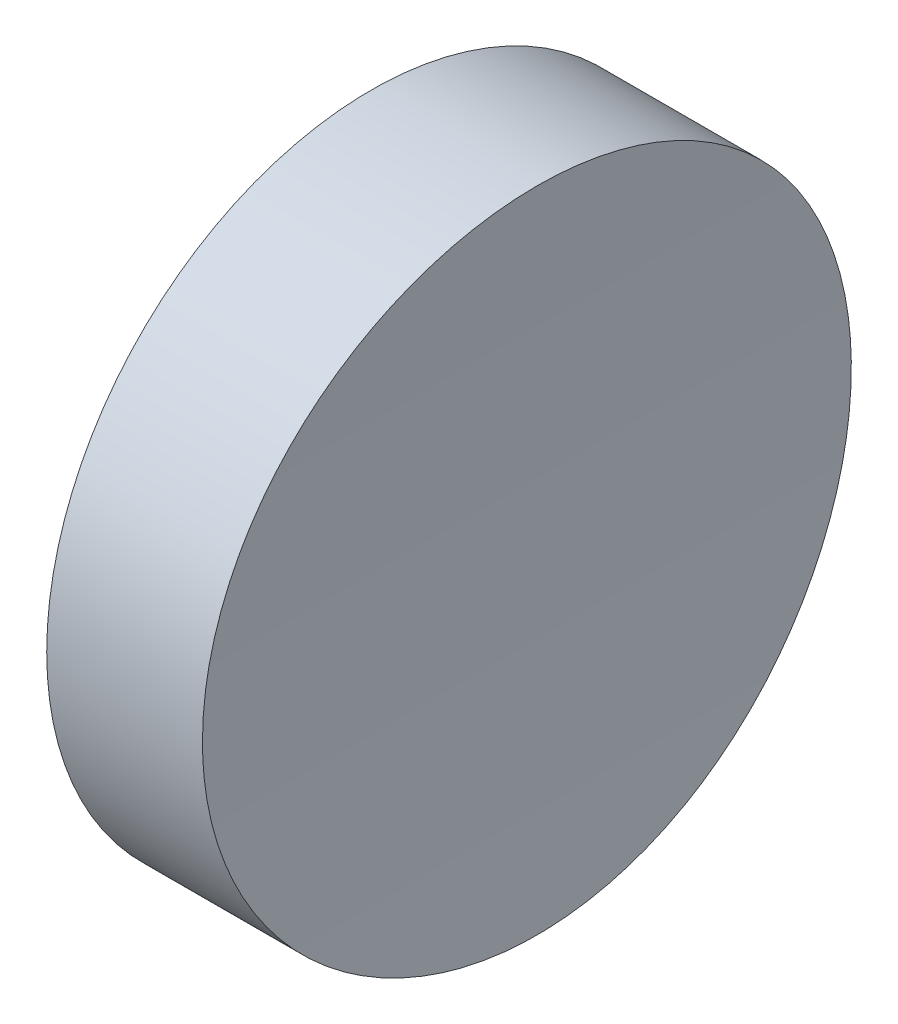
ISO-10303-21;
HEADER;
FILE_DESCRIPTION(('STEP AP214'),'2;1');
FILE_NAME('part.step','',(''),(''),'','','');
FILE_SCHEMA(('AUTOMOTIVE_DESIGN { 1 0 10303 214 1 1 1 1 }'));
ENDSEC;
DATA;
#1=APPLICATION_CONTEXT('core data for automotive mechanical design processes');
#2=APPLICATION_PROTOCOL_DEFINITION('international standard','automotive_design',2000,#1);
#3=PRODUCT_CONTEXT('',#1,'mechanical');
#4=PRODUCT('Part','Part','',(#3));
#5=PRODUCT_RELATED_PRODUCT_CATEGORY('part','',(#4));
#6=PRODUCT_DEFINITION_FORMATION('','',#4);
#7=PRODUCT_DEFINITION_CONTEXT('part definition',#1,'design');
#8=PRODUCT_DEFINITION('design','',#6,#7);
#9=PRODUCT_DEFINITION_SHAPE('','',#8);
#10=(LENGTH_UNIT() NAMED_UNIT(*) SI_UNIT(.MILLI.,.METRE.));
#11=(NAMED_UNIT(*) PLANE_ANGLE_UNIT() SI_UNIT($,.RADIAN.));
#12=(NAMED_UNIT(*) SI_UNIT($,.STERADIAN.) SOLID_ANGLE_UNIT());
#13=UNCERTAINTY_MEASURE_WITH_UNIT(LENGTH_MEASURE(1.E-05),#10,'distance_accuracy_value','');
#14=(GEOMETRIC_REPRESENTATION_CONTEXT(3) GLOBAL_UNCERTAINTY_ASSIGNED_CONTEXT((#13)) GLOBAL_UNIT_ASSIGNED_CONTEXT((#10,
#11,#12)) REPRESENTATION_CONTEXT('',''));
#15=CARTESIAN_POINT('',(0.,0.,0.));
#16=DIRECTION('',(0.,0.,1.));
#17=DIRECTION('',(1.,0.,0.));
#18=AXIS2_PLACEMENT_3D('',#15,#16,#17);
#19=CARTESIAN_POINT('',(10.,0.,0.));
#20=DIRECTION('',(-1.,0.,0.));
#21=DIRECTION('',(0.,0.,1.));
#22=AXIS2_PLACEMENT_3D('',#19,#20,#21);
#23=CYLINDRICAL_SURFACE('',#22,12.5);
#24=CARTESIAN_POINT('',(5.99999999999992,0.,12.5));
#25=CARTESIAN_POINT('',(5.99999950570722,0.350823394244744,12.5000028675567));
#26=CARTESIAN_POINT('',(6.00092499215874,0.701601062458643,12.4852248711399));
#27=CARTESIAN_POINT('',(6.00460002773068,1.40077506015951,12.4262185761951));
#28=CARTESIAN_POINT('',(6.0073500402031,1.7491707620156,12.3819827966325));
#29=CARTESIAN_POINT('',(6.0146010638511,2.44134253763402,12.2643069534608));
#30=CARTESIAN_POINT('',(6.01910389285262,2.78511343088805,12.1908365692167));
#31=CARTESIAN_POINT('',(6.02973251855967,3.46522609084671,12.0152216779054));
#32=CARTESIAN_POINT('',(6.03585831073109,3.80156787830334,11.9130772509454));
#33=CARTESIAN_POINT('',(6.04955556651045,4.46425369486591,11.6809091386842));
#34=CARTESIAN_POINT('',(6.05712625370846,4.79060298461518,11.5509004215809));
#35=CARTESIAN_POINT('',(6.07350127676264,5.43118554902062,11.2638982664122));
#36=CARTESIAN_POINT('',(6.08230563129448,5.7454186401659,11.1069044198288));
#37=CARTESIAN_POINT('',(6.1008966757231,6.35946808163436,10.7670919562141));
#38=CARTESIAN_POINT('',(6.11068313227066,6.65928783167089,10.5842794695534));
#39=CARTESIAN_POINT('',(6.13096354793478,7.24247288584447,10.1940998934515));
#40=CARTESIAN_POINT('',(6.14145750514836,7.52583823423567,9.98673287005427));
#41=CARTESIAN_POINT('',(6.1628706586267,8.07447956916569,9.5486218655922));
#42=CARTESIAN_POINT('',(6.17379039888895,8.33973113820361,9.31784733274768));
#43=CARTESIAN_POINT('',(6.19573274462473,8.84985778820492,8.83478422692142));
#44=CARTESIAN_POINT('',(6.20675535027827,9.09473283350395,8.58249561628584));
#45=CARTESIAN_POINT('',(6.22859151534565,9.56238286503092,8.05817846295991));
#46=CARTESIAN_POINT('',(6.23940506609768,9.78515693711716,7.78614910455674));
#47=CARTESIAN_POINT('',(6.26051597773508,10.2070143811261,7.22428346689211));
#48=CARTESIAN_POINT('',(6.27081333860385,10.4060977522867,6.93444718705789));
#49=CARTESIAN_POINT('',(6.29060755278427,10.7793104274797,6.33877700063591));
#50=CARTESIAN_POINT('',(6.30010375204829,10.9534194227291,6.03293034740701));
#51=CARTESIAN_POINT('',(6.31801597975412,11.2752493057727,5.40762412160928));
#52=CARTESIAN_POINT('',(6.32643200739648,11.4229701740366,5.08816453896549));
#53=CARTESIAN_POINT('',(6.34194390023474,11.6909650239585,4.43790493710456));
#54=CARTESIAN_POINT('',(6.34903977694458,11.8112392449995,4.10710501682406));
#55=CARTESIAN_POINT('',(6.36170889339094,12.0234785548578,3.43651662010671));
#56=CARTESIAN_POINT('',(6.36728213524502,12.115443683045,3.09672815617111));
#57=CARTESIAN_POINT('',(6.37674047137594,12.2703004238666,2.41103768551966));
#58=CARTESIAN_POINT('',(6.38062778210268,12.3332302155006,2.06514433153651));
#59=CARTESIAN_POINT('',(6.38661402477337,12.4297418499363,1.36927184685397));
#60=CARTESIAN_POINT('',(6.3887129581258,12.4633237158516,1.01929271937264));
#61=CARTESIAN_POINT('',(6.39106250885634,12.5008971743012,0.317747051041403));
#62=CARTESIAN_POINT('',(6.39131314511001,12.5048890690203,-0.0338194735606769));
#63=CARTESIAN_POINT('',(6.3899589902424,12.4832545622223,-0.736036269024496));
#64=CARTESIAN_POINT('',(6.38835420050512,12.4576281827981,-1.08668654056949));
#65=CARTESIAN_POINT('',(6.38333856540665,12.3769989136877,-1.78407942368158));
#66=CARTESIAN_POINT('',(6.37993026458498,12.3220374114244,-2.13082683955278));
#67=CARTESIAN_POINT('',(6.37140616939538,12.1831587875492,-2.81845181999067));
#68=CARTESIAN_POINT('',(6.36629037688288,12.0992416974015,-3.15932939093535));
#69=CARTESIAN_POINT('',(6.35449672575618,11.90305295897,-3.8327984131553));
#70=CARTESIAN_POINT('',(6.34781886017258,11.7907811841776,-4.16538982745343));
#71=CARTESIAN_POINT('',(6.33309071986885,11.5386857231379,-4.8199300789535));
#72=CARTESIAN_POINT('',(6.325040443696,11.3988620077261,-5.14187890488956));
#73=CARTESIAN_POINT('',(6.30778972790047,11.0925510924441,-5.77308040875765));
#74=CARTESIAN_POINT('',(6.29858848199047,10.9260451777159,-6.08232398254793));
#75=CARTESIAN_POINT('',(6.2793012734812,10.5676247697362,-6.68568886949746));
#76=CARTESIAN_POINT('',(6.26921531061101,10.3757102687039,-6.97981017802588));
#77=CARTESIAN_POINT('',(6.24844428483396,9.96783183603422,-7.55085720626045));
#78=CARTESIAN_POINT('',(6.2377592162607,9.75186767691375,-7.82778276327532));
#79=CARTESIAN_POINT('',(6.21609242533039,9.29741923787459,-8.36248184352079));
#80=CARTESIAN_POINT('',(6.20511070261599,9.05893493082739,-8.62025534367951));
#81=CARTESIAN_POINT('',(6.18314226561316,8.56070281616704,-9.11525609597018));
#82=CARTESIAN_POINT('',(6.17215557511685,8.30091920997781,-9.35244731841202));
#83=CARTESIAN_POINT('',(6.15050766915098,7.76228357920137,-9.80410550702363));
#84=CARTESIAN_POINT('',(6.13984645407885,7.48343153133225,-10.018572445447));
#85=CARTESIAN_POINT('',(6.11915179188945,6.90863284181357,-10.4232592503485));
#86=CARTESIAN_POINT('',(6.10911834545928,6.6126861814545,-10.6134790902882));
#87=CARTESIAN_POINT('',(6.08996378405533,6.00579510268701,-10.9683171760509));
#88=CARTESIAN_POINT('',(6.08084266860203,5.69485069216158,-11.1329354353303));
#89=CARTESIAN_POINT('',(6.06377109115239,5.06015254646639,-11.4354031241965));
#90=CARTESIAN_POINT('',(6.05582069101923,4.73639813553404,-11.5732511393073));
#91=CARTESIAN_POINT('',(6.04131683959548,4.07839561091185,-11.8211800614639));
#92=CARTESIAN_POINT('',(6.03476338862824,3.74414749479315,-11.9312609620825));
#93=CARTESIAN_POINT('',(6.02323967574661,3.06754004962057,-12.1228636904028));
#94=CARTESIAN_POINT('',(6.01826939870041,2.72518079812567,-12.2043857910671));
#95=CARTESIAN_POINT('',(6.01005324747031,2.03478924007744,-12.338284911923));
#96=CARTESIAN_POINT('',(6.00680737079382,1.68675694172513,-12.3906619742432));
#97=CARTESIAN_POINT('',(6.00213626595477,0.988094412778155,-12.4658295437162));
#98=CARTESIAN_POINT('',(6.00070797418445,0.637469558326468,-12.4886698372609));
#99=CARTESIAN_POINT('',(5.99970244959819,-0.0644609564551338,-12.5047625229049));
#100=CARTESIAN_POINT('',(6.0001252147112,-0.415766616022895,-12.4980149481084));
#101=CARTESIAN_POINT('',(6.002809808013,-1.11655501082829,-12.4549806722953));
#102=CARTESIAN_POINT('',(6.00507162697695,-1.46603775520095,-12.4186941194485));
#103=CARTESIAN_POINT('',(6.0113701924427,-2.16069427273361,-12.3168433680926));
#104=CARTESIAN_POINT('',(6.01540693875525,-2.50586804635305,-12.2512791727054));
#105=CARTESIAN_POINT('',(6.02513707990676,-3.18917990534861,-12.0914082078022));
#106=CARTESIAN_POINT('',(6.03082915488918,-3.52732336699013,-11.9971243347479));
#107=CARTESIAN_POINT('',(6.04371021534443,-4.19446011026222,-11.7804714211403));
#108=CARTESIAN_POINT('',(6.0508991997356,-4.52345339850439,-11.6581024008809));
#109=CARTESIAN_POINT('',(6.06657097773414,-5.1699641022172,-11.3861519189431));
#110=CARTESIAN_POINT('',(6.07505378036708,-5.48748143761349,-11.2365702674304));
#111=CARTESIAN_POINT('',(6.09307359153922,-6.10879515069731,-10.9112596327516));
#112=CARTESIAN_POINT('',(6.10261060153338,-6.41259150944709,-10.7355306134981));
#113=CARTESIAN_POINT('',(6.12248287547514,-7.00471502847722,-10.3589209196804));
#114=CARTESIAN_POINT('',(6.13281918708632,-7.29302101718601,-10.1580070130507));
#115=CARTESIAN_POINT('',(6.15398645860913,-7.85168958021716,-9.73263754465294));
#116=CARTESIAN_POINT('',(6.16481741891399,-8.12205214027473,-9.50818196416997));
#117=CARTESIAN_POINT('',(6.18666764269765,-8.64292647155839,-9.03731593005726));
#118=CARTESIAN_POINT('',(6.19768690782464,-8.89343806892527,-8.79090528418025));
#119=CARTESIAN_POINT('',(6.21960178868562,-9.37283761479197,-8.27787242971715));
#120=CARTESIAN_POINT('',(6.23049740432973,-9.60172554757307,-8.01125020643909));
#121=CARTESIAN_POINT('',(6.25187128639913,-10.0365603544782,-7.45929364522592));
#122=CARTESIAN_POINT('',(6.26234895152769,-10.242474891454,-7.17393380737702));
#123=CARTESIAN_POINT('',(6.28257304979915,-10.6295317460505,-6.58685610178037));
#124=CARTESIAN_POINT('',(6.29231948215488,-10.8106740370039,-6.28513821642369));
#125=CARTESIAN_POINT('',(6.31080370249099,-11.1468939229179,-5.66748531506219));
#126=CARTESIAN_POINT('',(6.31954149511792,-11.3019716379532,-5.35155036456123));
#127=CARTESIAN_POINT('',(6.33575949050724,-11.5849540865926,-4.70770561583437));
#128=CARTESIAN_POINT('',(6.34323969462351,-11.7128588494505,-4.37979583050071));
#129=CARTESIAN_POINT('',(6.35672420998243,-11.940495547071,-3.71457417939862));
#130=CARTESIAN_POINT('',(6.3627295836209,-12.0402477693223,-3.3772692775881));
#131=CARTESIAN_POINT('',(6.37310011550648,-12.2109854768174,-2.695430784273));
#132=CARTESIAN_POINT('',(6.37746527428085,-12.2819709713087,-2.35089719509224));
#133=CARTESIAN_POINT('',(6.38443068432933,-12.3946633668293,-1.65705960879677));
#134=CARTESIAN_POINT('',(6.3870309499725,-12.4363705062315,-1.30775565054413));
#135=CARTESIAN_POINT('',(6.39039230839596,-12.4902060692884,-0.606867086379862));
#136=CARTESIAN_POINT('',(6.39115340339205,-12.5023345285787,-0.255282483216404));
#137=CARTESIAN_POINT('',(6.39081496960755,-12.4969299379352,0.447054469449508));
#138=CARTESIAN_POINT('',(6.3897186277869,-12.4794476935797,0.797807212533487));
#139=CARTESIAN_POINT('',(6.38570265472211,-12.4150446259058,1.49658860228933));
#140=CARTESIAN_POINT('',(6.3827830257063,-12.3681238385655,1.84461725228992));
#141=CARTESIAN_POINT('',(6.37520362360935,-12.2451810263819,2.53547676783788));
#142=CARTESIAN_POINT('',(6.37054384870552,-12.169158971057,2.87830762794053));
#143=CARTESIAN_POINT('',(6.35961675202626,-11.9885591762643,3.55633718856524));
#144=CARTESIAN_POINT('',(6.35334942939898,-11.8839814216648,3.89153588504287));
#145=CARTESIAN_POINT('',(6.33938545101145,-11.6470198896726,4.55192177671166));
#146=CARTESIAN_POINT('',(6.33168880830208,-11.5146363661683,4.87710906328373));
#147=CARTESIAN_POINT('',(6.31508464270175,-11.2230074191611,5.51517437643595));
#148=CARTESIAN_POINT('',(6.30617711984057,-11.0637619963193,5.82805240331906));
#149=CARTESIAN_POINT('',(6.28740397561558,-10.7195467206476,6.43928069484894));
#150=CARTESIAN_POINT('',(6.27753838077605,-10.5345775799192,6.7376313613435));
#151=CARTESIAN_POINT('',(6.25712818938594,-10.1402232121164,7.31770969498245));
#152=CARTESIAN_POINT('',(6.24658359252716,-9.93083797395927,7.59943735458138));
#153=CARTESIAN_POINT('',(6.22509641797749,-9.48877907784585,8.14471946228065));
#154=CARTESIAN_POINT('',(6.2141532314984,-9.25606875572914,8.40824416369982));
#155=CARTESIAN_POINT('',(6.192194945083,-8.76928623177999,8.91476301098801));
#156=CARTESIAN_POINT('',(6.18117984479418,-8.51521392516224,9.15775705613783));
#157=CARTESIAN_POINT('',(6.15938707860183,-7.98743898033064,9.62155195906246));
#158=CARTESIAN_POINT('',(6.14860947291179,-7.71373143705191,9.8423472380655));
#159=CARTESIAN_POINT('',(6.12760010253412,-7.14868319278529,10.2601061288948));
#160=CARTESIAN_POINT('',(6.11736832955978,-6.85734275963961,10.4570701025804));
#161=CARTESIAN_POINT('',(6.09772813839971,-6.25871259130723,10.8260004516899));
#162=CARTESIAN_POINT('',(6.08832076283322,-5.95140342064122,10.9979353492688));
#163=CARTESIAN_POINT('',(6.07061100957982,-5.32335416562618,11.3152858742779));
#164=CARTESIAN_POINT('',(6.06230863507054,-5.00261404265766,11.4607014254477));
#165=CARTESIAN_POINT('',(6.04705302296762,-4.35031957813254,11.7238329207212));
#166=CARTESIAN_POINT('',(6.04009837937708,-4.01877693266972,11.8415777593978));
#167=CARTESIAN_POINT('',(6.02772631552774,-3.34703298314697,12.0486889673462));
#168=CARTESIAN_POINT('',(6.0223085016411,-3.00683392062327,12.1380626040271));
#169=CARTESIAN_POINT('',(6.01191595523067,-2.22642959352073,12.3082476794833));
#170=CARTESIAN_POINT('',(6.00746419002863,-1.7842325615361,12.3800906987553));
#171=CARTESIAN_POINT('',(6.00150652955833,-0.894665570939044,12.4759649979119));
#172=CARTESIAN_POINT('',(6.00000063021719,-0.447295619479397,12.4999963438996));
#173=CARTESIAN_POINT('',(5.99999999999992,0.,12.5));
#174=B_SPLINE_CURVE_WITH_KNOTS('',3,(#24,#25,#26,#27,#28,#29,#30,#31,#32,#33,#34,#35,#36,#37,
#38,#39,#40,#41,#42,#43,#44,#45,#46,#47,#48,#49,#50,#51,#52,#53,#54,#55,#56,#57,#58,#59,#60,#61,
#62,#63,#64,#65,#66,#67,#68,#69,#70,#71,#72,#73,#74,#75,#76,#77,#78,#79,#80,#81,#82,#83,#84,#85,
#86,#87,#88,#89,#90,#91,#92,#93,#94,#95,#96,#97,#98,#99,#100,#101,#102,#103,#104,#105,#106,#107,
#108,#109,#110,#111,#112,#113,#114,#115,#116,#117,#118,#119,#120,#121,#122,#123,#124,#125,#126,
#127,#128,#129,#130,#131,#132,#133,#134,#135,#136,#137,#138,#139,#140,#141,#142,#143,#144,#145,
#146,#147,#148,#149,#150,#151,#152,#153,#154,#155,#156,#157,#158,#159,#160,#161,#162,#163,#164,
#165,#166,#167,#168,#169,#170,#171,#172,#173),.UNSPECIFIED.,.T.,.F.,(4,2,2,2,2,2,2,2,2,2,2,2,2,
2,2,2,2,2,2,2,2,2,2,2,2,2,2,2,2,2,2,2,2,2,2,2,2,2,2,2,2,2,2,2,2,2,2,2,2,2,2,2,2,2,2,2,2,2,2,2,2,
2,2,2,2,2,2,2,2,2,2,2,2,2,4),(0.,1.05207930200567,2.10442588973256,3.15786677422096,
4.21130471571995,5.26417818123077,6.31706758721142,7.36970741442568,8.42234441043154,
9.47637344690187,10.5304043281664,11.5844787881554,12.6385532820489,13.6934801321384,
14.748407762995,15.8033261926753,16.8582431552553,17.9117690105761,18.9652940361706,
20.0188083027284,21.0723217834521,22.1243528296924,23.1763827327569,24.2284173296854,
25.280453040224,26.3332299031802,27.3860070885227,28.4387942328118,29.4915826453389,
30.5461782948687,31.6007752320461,32.655373323468,33.7099708605874,34.7646241049809,
35.8192775934858,36.8739210014231,37.9285628848946,38.9814247649938,40.0342854671075,
41.0871408880213,42.1399961966705,43.1920143146484,44.2440316724525,45.2960563693726,
46.3480825182569,47.4015117493782,48.4549418179518,49.5083811116846,50.5618211711794,
51.6167258180708,52.6716316005569,53.7265325231553,54.7814323100688,55.8355699549763,
56.8897072610131,57.9438359845759,58.9979634381512,60.0502840680685,61.1026034118969,
62.1549238579629,63.2072448616611,64.2595562572651,65.3118676269697,66.3641498716651,
67.4164325940049,68.4703961175896,69.5243648114036,70.5785977194599,71.6328146178194,
72.6883461064152,73.7438806303051,74.7983079870834,75.8524650292664,77.1938553740338,
78.5352438642318),.UNSPECIFIED.);
#175=CARTESIAN_POINT('',(5.99999999999992,0.,12.5));
#176=VERTEX_POINT('',#175);
#177=EDGE_CURVE('E10',#176,#176,#174,.T.);
#178=ORIENTED_EDGE('',*,*,#177,.T.);
#179=EDGE_LOOP('',(#178));
#180=FACE_BOUND('',#179,.T.);
#181=CARTESIAN_POINT('',(0.,0.,0.));
#182=DIRECTION('',(1.,0.,0.));
#183=DIRECTION('',(0.,0.,-1.));
#184=AXIS2_PLACEMENT_3D('',#181,#182,#183);
#185=CIRCLE('',#184,12.5);
#186=CARTESIAN_POINT('',(0.,0.,-12.5));
#187=VERTEX_POINT('',#186);
#188=EDGE_CURVE('E45',#187,#187,#185,.T.);
#189=ORIENTED_EDGE('',*,*,#188,.T.);
#190=EDGE_LOOP('',(#189));
#191=FACE_BOUND('',#190,.T.);
#192=ADVANCED_FACE('F34',(#180,#191),#23,.T.);
#193=CARTESIAN_POINT('',(0.,0.,0.));
#194=DIRECTION('',(1.,0.,0.));
#195=DIRECTION('',(0.,0.,-1.));
#196=AXIS2_PLACEMENT_3D('',#193,#194,#195);
#197=PLANE('',#196);
#198=ORIENTED_EDGE('',*,*,#188,.F.);
#199=EDGE_LOOP('',(#198));
#200=FACE_BOUND('',#199,.T.);
#201=ADVANCED_FACE('F52',(#200),#197,.F.);
#202=CARTESIAN_POINT('',(206.,0.,-12.5));
#203=DIRECTION('',(0.,0.,1.));
#204=DIRECTION('',(1.,0.,0.));
#205=AXIS2_PLACEMENT_3D('',#202,#203,#204);
#206=CYLINDRICAL_SURFACE('',#205,200.);
#207=ORIENTED_EDGE('',*,*,#177,.F.);
#208=EDGE_LOOP('',(#207));
#209=FACE_BOUND('',#208,.T.);
#210=ADVANCED_FACE('F54',(#209),#206,.F.);
#211=CLOSED_SHELL('',(#192,#201,#210));
#212=MANIFOLD_SOLID_BREP('B2',#211);
#213=ADVANCED_BREP_SHAPE_REPRESENTATION('',(#18,#212),#14);
#214=SHAPE_DEFINITION_REPRESENTATION(#9,#213);
ENDSEC;
END-ISO-10303-21;
